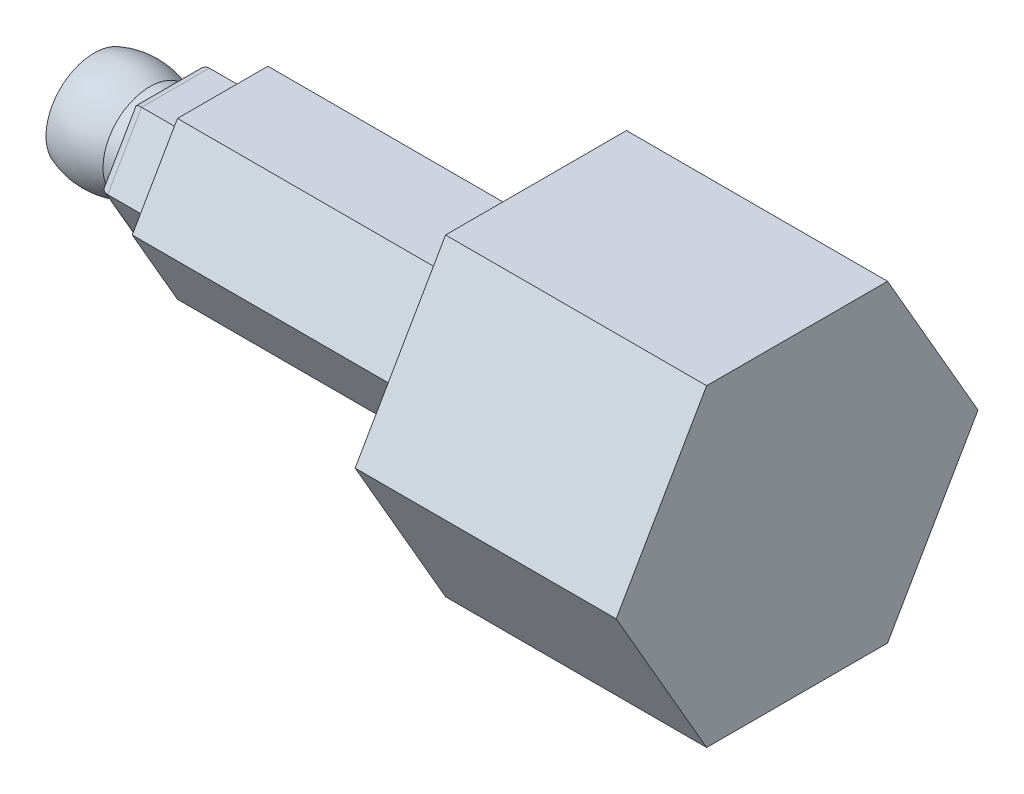
ISO-10303-21;
HEADER;
FILE_DESCRIPTION(('STEP AP214'),'2;1');
FILE_NAME('part.step','',(''),(''),'','','');
FILE_SCHEMA(('AUTOMOTIVE_DESIGN { 1 0 10303 214 1 1 1 1 }'));
ENDSEC;
DATA;
#1=APPLICATION_CONTEXT('core data for automotive mechanical design processes');
#2=APPLICATION_PROTOCOL_DEFINITION('international standard','automotive_design',2000,#1);
#3=PRODUCT_CONTEXT('',#1,'mechanical');
#4=PRODUCT('Part','Part','',(#3));
#5=PRODUCT_RELATED_PRODUCT_CATEGORY('part','',(#4));
#6=PRODUCT_DEFINITION_FORMATION('','',#4);
#7=PRODUCT_DEFINITION_CONTEXT('part definition',#1,'design');
#8=PRODUCT_DEFINITION('design','',#6,#7);
#9=PRODUCT_DEFINITION_SHAPE('','',#8);
#10=(LENGTH_UNIT() NAMED_UNIT(*) SI_UNIT(.MILLI.,.METRE.));
#11=(NAMED_UNIT(*) PLANE_ANGLE_UNIT() SI_UNIT($,.RADIAN.));
#12=(NAMED_UNIT(*) SI_UNIT($,.STERADIAN.) SOLID_ANGLE_UNIT());
#13=UNCERTAINTY_MEASURE_WITH_UNIT(LENGTH_MEASURE(1.E-05),#10,'distance_accuracy_value','');
#14=(GEOMETRIC_REPRESENTATION_CONTEXT(3) GLOBAL_UNCERTAINTY_ASSIGNED_CONTEXT((#13)) GLOBAL_UNIT_ASSIGNED_CONTEXT((#10,
#11,#12)) REPRESENTATION_CONTEXT('',''));
#15=CARTESIAN_POINT('',(0.,0.,0.));
#16=DIRECTION('',(0.,0.,1.));
#17=DIRECTION('',(1.,0.,0.));
#18=AXIS2_PLACEMENT_3D('',#15,#16,#17);
#19=CARTESIAN_POINT('',(149.3393,5.842,0.));
#20=DIRECTION('',(1.,0.,0.));
#21=DIRECTION('',(0.,1.,0.));
#22=AXIS2_PLACEMENT_3D('',#19,#20,#21);
#23=PLANE('',#22);
#24=CARTESIAN_POINT('',(149.3393,0.,0.));
#25=DIRECTION('',(-1.,0.,0.));
#26=DIRECTION('',(0.,-1.,0.));
#27=AXIS2_PLACEMENT_3D('',#24,#25,#26);
#28=CIRCLE('',#27,4.826);
#29=CARTESIAN_POINT('',(149.3393,-4.826,0.));
#30=VERTEX_POINT('',#29);
#31=EDGE_CURVE('E382',#30,#30,#28,.T.);
#32=ORIENTED_EDGE('',*,*,#31,.F.);
#33=EDGE_LOOP('',(#32));
#34=FACE_BOUND('',#33,.T.);
#35=CARTESIAN_POINT('',(149.3393,0.,0.));
#36=DIRECTION('',(-1.,0.,0.));
#37=DIRECTION('',(0.,-1.,0.));
#38=AXIS2_PLACEMENT_3D('',#35,#36,#37);
#39=CIRCLE('',#38,5.842);
#40=CARTESIAN_POINT('',(149.3393,-5.842,0.));
#41=VERTEX_POINT('',#40);
#42=EDGE_CURVE('E378',#41,#41,#39,.T.);
#43=ORIENTED_EDGE('',*,*,#42,.T.);
#44=EDGE_LOOP('',(#43));
#45=FACE_BOUND('',#44,.T.);
#46=ADVANCED_FACE('F66',(#34,#45),#23,.F.);
#47=CARTESIAN_POINT('',(149.3393,0.,0.));
#48=DIRECTION('',(-1.,0.,0.));
#49=DIRECTION('',(0.,-1.,0.));
#50=AXIS2_PLACEMENT_3D('',#47,#48,#49);
#51=CYLINDRICAL_SURFACE('',#50,4.826);
#52=CARTESIAN_POINT('',(156.9593,0.,0.));
#53=DIRECTION('',(-1.,0.,0.));
#54=DIRECTION('',(0.,-1.,0.));
#55=AXIS2_PLACEMENT_3D('',#52,#53,#54);
#56=CIRCLE('',#55,4.826);
#57=CARTESIAN_POINT('',(156.9593,-4.826,0.));
#58=VERTEX_POINT('',#57);
#59=EDGE_CURVE('E386',#58,#58,#56,.T.);
#60=ORIENTED_EDGE('',*,*,#59,.F.);
#61=EDGE_LOOP('',(#60));
#62=FACE_BOUND('',#61,.T.);
#63=ORIENTED_EDGE('',*,*,#31,.T.);
#64=EDGE_LOOP('',(#63));
#65=FACE_BOUND('',#64,.T.);
#66=ADVANCED_FACE('F497',(#62,#65),#51,.F.);
#67=CARTESIAN_POINT('',(156.9593,0.,0.));
#68=DIRECTION('',(-1.,0.,0.));
#69=DIRECTION('',(0.,-1.,0.));
#70=AXIS2_PLACEMENT_3D('',#67,#68,#69);
#71=CONICAL_SURFACE('',#70,4.826,0.349065850398867);
#72=CARTESIAN_POINT('',(159.4993,0.,0.));
#73=DIRECTION('',(-1.,0.,0.));
#74=DIRECTION('',(0.,-1.,0.));
#75=AXIS2_PLACEMENT_3D('',#72,#73,#74);
#76=CIRCLE('',#75,3.90151560496384);
#77=CARTESIAN_POINT('',(159.4993,-3.90151560496383,0.));
#78=VERTEX_POINT('',#77);
#79=EDGE_CURVE('E390',#78,#78,#76,.T.);
#80=ORIENTED_EDGE('',*,*,#79,.F.);
#81=EDGE_LOOP('',(#80));
#82=FACE_BOUND('',#81,.T.);
#83=ORIENTED_EDGE('',*,*,#59,.T.);
#84=EDGE_LOOP('',(#83));
#85=FACE_BOUND('',#84,.T.);
#86=ADVANCED_FACE('F503',(#82,#85),#71,.F.);
#87=CARTESIAN_POINT('',(159.4993,4.572,0.));
#88=DIRECTION('',(-1.,0.,0.));
#89=DIRECTION('',(0.,-1.,0.));
#90=AXIS2_PLACEMENT_3D('',#87,#88,#89);
#91=PLANE('',#90);
#92=CARTESIAN_POINT('',(159.4993,0.,0.));
#93=DIRECTION('',(-1.,0.,0.));
#94=DIRECTION('',(0.,-1.,0.));
#95=AXIS2_PLACEMENT_3D('',#92,#93,#94);
#96=CIRCLE('',#95,4.572);
#97=CARTESIAN_POINT('',(159.4993,-4.572,0.));
#98=VERTEX_POINT('',#97);
#99=EDGE_CURVE('E394',#98,#98,#96,.T.);
#100=ORIENTED_EDGE('',*,*,#99,.F.);
#101=EDGE_LOOP('',(#100));
#102=FACE_BOUND('',#101,.T.);
#103=ORIENTED_EDGE('',*,*,#79,.T.);
#104=EDGE_LOOP('',(#103));
#105=FACE_BOUND('',#104,.T.);
#106=ADVANCED_FACE('F514',(#102,#105),#91,.F.);
#107=CARTESIAN_POINT('',(149.3393,0.,0.));
#108=DIRECTION('',(-1.,0.,0.));
#109=DIRECTION('',(0.,-1.,0.));
#110=AXIS2_PLACEMENT_3D('',#107,#108,#109);
#111=CYLINDRICAL_SURFACE('',#110,4.572);
#112=ORIENTED_EDGE('',*,*,#99,.T.);
#113=EDGE_LOOP('',(#112));
#114=FACE_BOUND('',#113,.T.);
#115=CARTESIAN_POINT('',(164.9857,0.,0.));
#116=DIRECTION('',(1.,0.,0.));
#117=DIRECTION('',(0.,0.,-1.));
#118=AXIS2_PLACEMENT_3D('',#115,#116,#117);
#119=CIRCLE('',#118,4.572);
#120=CARTESIAN_POINT('',(164.9857,0.,-4.572));
#121=VERTEX_POINT('',#120);
#122=EDGE_CURVE('E70',#121,#121,#119,.F.);
#123=ORIENTED_EDGE('',*,*,#122,.F.);
#124=EDGE_LOOP('',(#123));
#125=FACE_BOUND('',#124,.T.);
#126=ADVANCED_FACE('F68',(#114,#125),#111,.F.);
#127=CARTESIAN_POINT('',(152.545582614775,0.,0.));
#128=DIRECTION('',(-1.,0.,0.));
#129=DIRECTION('',(0.,-1.,0.));
#130=AXIS2_PLACEMENT_3D('',#127,#128,#129);
#131=DEGENERATE_TOROIDAL_SURFACE('',#130,2.44967364252799,8.89,.F.);
#132=ORIENTED_EDGE('',*,*,#42,.F.);
#133=EDGE_LOOP('',(#132));
#134=FACE_BOUND('',#133,.T.);
#135=CARTESIAN_POINT('',(156.1211,0.,0.));
#136=DIRECTION('',(-1.,0.,0.));
#137=DIRECTION('',(0.,-1.,0.));
#138=AXIS2_PLACEMENT_3D('',#135,#136,#137);
#139=CIRCLE('',#138,5.68960000000005);
#140=CARTESIAN_POINT('',(156.1211,-5.68960000000005,0.));
#141=VERTEX_POINT('',#140);
#142=EDGE_CURVE('E374',#141,#141,#139,.T.);
#143=ORIENTED_EDGE('',*,*,#142,.T.);
#144=EDGE_LOOP('',(#143));
#145=FACE_BOUND('',#144,.T.);
#146=ADVANCED_FACE('F509',(#134,#145),#131,.F.);
#147=CARTESIAN_POINT('',(149.3393,0.,0.));
#148=DIRECTION('',(-1.,0.,0.));
#149=DIRECTION('',(0.,-1.,0.));
#150=AXIS2_PLACEMENT_3D('',#147,#148,#149);
#151=CYLINDRICAL_SURFACE('',#150,5.68960000000005);
#152=ORIENTED_EDGE('',*,*,#142,.F.);
#153=EDGE_LOOP('',(#152));
#154=FACE_BOUND('',#153,.T.);
#155=CARTESIAN_POINT('',(158.0515,0.,0.));
#156=DIRECTION('',(-1.,0.,0.));
#157=DIRECTION('',(0.,-1.,0.));
#158=AXIS2_PLACEMENT_3D('',#155,#156,#157);
#159=CIRCLE('',#158,5.68960000000005);
#160=CARTESIAN_POINT('',(158.0515,-5.68960000000004,0.));
#161=VERTEX_POINT('',#160);
#162=EDGE_CURVE('E370',#161,#161,#159,.T.);
#163=ORIENTED_EDGE('',*,*,#162,.T.);
#164=EDGE_LOOP('',(#163));
#165=FACE_BOUND('',#164,.T.);
#166=ADVANCED_FACE('F544',(#154,#165),#151,.T.);
#167=CARTESIAN_POINT('',(158.0515,7.1374,0.));
#168=DIRECTION('',(1.,0.,0.));
#169=DIRECTION('',(0.,1.,0.));
#170=AXIS2_PLACEMENT_3D('',#167,#168,#169);
#171=PLANE('',#170);
#172=DIRECTION('',(0.,0.,1.));
#173=VECTOR('',#172,1.);
#174=CARTESIAN_POINT('',(158.0515,-5.94677499999997,4.12077981131404));
#175=LINE('',#174,#173);
#176=CARTESIAN_POINT('',(158.0515,-5.94677499999997,-3.43337214706014));
#177=VERTEX_POINT('',#176);
#178=CARTESIAN_POINT('',(158.0515,-5.94677499999997,3.43337214706014));
#179=VERTEX_POINT('',#178);
#180=EDGE_CURVE('E358',#177,#179,#175,.T.);
#181=ORIENTED_EDGE('',*,*,#180,.T.);
#182=DIRECTION('',(0.,0.866025403784439,0.5));
#183=VECTOR('',#182,1.);
#184=CARTESIAN_POINT('',(158.0515,0.59531250000003,7.21044812624722));
#185=LINE('',#184,#183);
#186=CARTESIAN_POINT('',(158.0515,0.,6.86674429412027));
#187=VERTEX_POINT('',#186);
#188=EDGE_CURVE('E351',#179,#187,#185,.T.);
#189=ORIENTED_EDGE('',*,*,#188,.T.);
#190=DIRECTION('',(0.,0.866025403784439,-0.5));
#191=VECTOR('',#190,1.);
#192=CARTESIAN_POINT('',(158.0515,6.54208750000003,3.08966831493319));
#193=LINE('',#192,#191);
#194=CARTESIAN_POINT('',(158.0515,5.94677500000003,3.43337214706014));
#195=VERTEX_POINT('',#194);
#196=EDGE_CURVE('E354',#187,#195,#193,.T.);
#197=ORIENTED_EDGE('',*,*,#196,.T.);
#198=DIRECTION('',(0.,0.,-1.));
#199=VECTOR('',#198,1.);
#200=CARTESIAN_POINT('',(158.0515,5.94677500000003,-4.12077981131404));
#201=LINE('',#200,#199);
#202=CARTESIAN_POINT('',(158.0515,5.94677500000003,-3.43337214706014));
#203=VERTEX_POINT('',#202);
#204=EDGE_CURVE('E367',#195,#203,#201,.T.);
#205=ORIENTED_EDGE('',*,*,#204,.T.);
#206=DIRECTION('',(0.,-0.866025403784439,-0.5));
#207=VECTOR('',#206,1.);
#208=CARTESIAN_POINT('',(158.0515,-0.595312499999976,-7.21044812624722));
#209=LINE('',#208,#207);
#210=CARTESIAN_POINT('',(158.0515,0.,-6.86674429412027));
#211=VERTEX_POINT('',#210);
#212=EDGE_CURVE('E364',#203,#211,#209,.T.);
#213=ORIENTED_EDGE('',*,*,#212,.T.);
#214=DIRECTION('',(0.,-0.866025403784439,0.5));
#215=VECTOR('',#214,1.);
#216=CARTESIAN_POINT('',(158.0515,-6.54208749999997,-3.08966831493319));
#217=LINE('',#216,#215);
#218=EDGE_CURVE('E361',#211,#177,#217,.T.);
#219=ORIENTED_EDGE('',*,*,#218,.T.);
#220=EDGE_LOOP('',(#181,#189,#197,#205,#213,#219));
#221=FACE_BOUND('',#220,.T.);
#222=ORIENTED_EDGE('',*,*,#162,.F.);
#223=EDGE_LOOP('',(#222));
#224=FACE_BOUND('',#223,.T.);
#225=ADVANCED_FACE('F455',(#221,#224),#171,.F.);
#226=CARTESIAN_POINT('',(159.242125,8.32643750000001,2.05947336210469));
#227=DIRECTION('',(0.,-0.866025403784439,0.5));
#228=DIRECTION('',(0.,-0.5,-0.866025403784439));
#229=AXIS2_PLACEMENT_3D('',#226,#227,#228);
#230=CYLINDRICAL_SURFACE('',#229,1.190625);
#231=CARTESIAN_POINT('',(159.242125,0.,6.86674429412027));
#232=DIRECTION('',(0.,-1.,0.));
#233=DIRECTION('',(0.,0.,-1.));
#234=AXIS2_PLACEMENT_3D('',#231,#232,#233);
#235=ELLIPSE('',#234,1.3748153285078,1.190625);
#236=CARTESIAN_POINT('',(159.242125,0.,8.24155962262807));
#237=VERTEX_POINT('',#236);
#238=EDGE_CURVE('E76',#187,#237,#235,.F.);
#239=ORIENTED_EDGE('',*,*,#238,.T.);
#240=DIRECTION('',(0.,0.866025403784439,-0.5));
#241=VECTOR('',#240,1.);
#242=CARTESIAN_POINT('',(159.242125,0.,8.24155962262807));
#243=LINE('',#242,#241);
#244=CARTESIAN_POINT('',(159.242125,7.13740000000003,4.12077981131404));
#245=VERTEX_POINT('',#244);
#246=EDGE_CURVE('E347',#245,#237,#243,.F.);
#247=ORIENTED_EDGE('',*,*,#246,.F.);
#248=CARTESIAN_POINT('',(159.242125,5.94677500000003,3.43337214706014));
#249=DIRECTION('',(0.,-0.5,0.866025403784439));
#250=DIRECTION('',(0.,0.866025403784439,0.5));
#251=AXIS2_PLACEMENT_3D('',#248,#249,#250);
#252=ELLIPSE('',#251,1.3748153285078,1.190625);
#253=EDGE_CURVE('E12',#245,#195,#252,.T.);
#254=ORIENTED_EDGE('',*,*,#253,.T.);
#255=ORIENTED_EDGE('',*,*,#196,.F.);
#256=EDGE_LOOP('',(#239,#247,#254,#255));
#257=FACE_BOUND('',#256,.T.);
#258=ADVANCED_FACE('F459',(#257),#230,.T.);
#259=CARTESIAN_POINT('',(159.242125,5.94677500000003,0.));
#260=DIRECTION('',(0.,0.,1.));
#261=DIRECTION('',(0.,-1.,0.));
#262=AXIS2_PLACEMENT_3D('',#259,#260,#261);
#263=CYLINDRICAL_SURFACE('',#262,1.190625);
#264=CARTESIAN_POINT('',(159.242125,5.94677500000003,-3.43337214706014));
#265=DIRECTION('',(0.,0.5,0.866025403784438));
#266=DIRECTION('',(0.,-0.866025403784438,0.5));
#267=AXIS2_PLACEMENT_3D('',#264,#265,#266);
#268=ELLIPSE('',#267,1.3748153285078,1.190625);
#269=CARTESIAN_POINT('',(159.242125,7.13740000000003,-4.12077981131404));
#270=VERTEX_POINT('',#269);
#271=EDGE_CURVE('E326',#270,#203,#268,.T.);
#272=ORIENTED_EDGE('',*,*,#271,.T.);
#273=ORIENTED_EDGE('',*,*,#204,.F.);
#274=ORIENTED_EDGE('',*,*,#253,.F.);
#275=DIRECTION('',(0.,0.,-1.));
#276=VECTOR('',#275,1.);
#277=CARTESIAN_POINT('',(159.242125,7.13740000000003,4.12077981131404));
#278=LINE('',#277,#276);
#279=EDGE_CURVE('E332',#270,#245,#278,.F.);
#280=ORIENTED_EDGE('',*,*,#279,.F.);
#281=EDGE_LOOP('',(#272,#273,#274,#280));
#282=FACE_BOUND('',#281,.T.);
#283=ADVANCED_FACE('F453',(#282),#263,.T.);
#284=CARTESIAN_POINT('',(159.242125,2.37966250000001,8.24064307907572));
#285=DIRECTION('',(0.,-0.866025403784439,-0.5));
#286=DIRECTION('',(0.,0.5,-0.866025403784439));
#287=AXIS2_PLACEMENT_3D('',#284,#285,#286);
#288=CYLINDRICAL_SURFACE('',#287,1.190625);
#289=CARTESIAN_POINT('',(159.242125,-5.94677499999997,3.43337214706014));
#290=DIRECTION('',(0.,-0.5,-0.866025403784439));
#291=DIRECTION('',(0.,-0.866025403784439,0.5));
#292=AXIS2_PLACEMENT_3D('',#289,#290,#291);
#293=ELLIPSE('',#292,1.3748153285078,1.190625);
#294=CARTESIAN_POINT('',(159.242125,-7.13739999999997,4.12077981131404));
#295=VERTEX_POINT('',#294);
#296=EDGE_CURVE('E322',#179,#295,#293,.F.);
#297=ORIENTED_EDGE('',*,*,#296,.T.);
#298=DIRECTION('',(0.,0.866025403784439,0.5));
#299=VECTOR('',#298,1.);
#300=CARTESIAN_POINT('',(159.242125,-7.13739999999997,4.12077981131404));
#301=LINE('',#300,#299);
#302=EDGE_CURVE('E341',#237,#295,#301,.F.);
#303=ORIENTED_EDGE('',*,*,#302,.F.);
#304=ORIENTED_EDGE('',*,*,#238,.F.);
#305=ORIENTED_EDGE('',*,*,#188,.F.);
#306=EDGE_LOOP('',(#297,#303,#304,#305));
#307=FACE_BOUND('',#306,.T.);
#308=ADVANCED_FACE('F462',(#307),#288,.T.);
#309=CARTESIAN_POINT('',(164.9857,3.56870000000001,6.18116971697107));
#310=DIRECTION('',(0.,0.5,0.866025403784439));
#311=DIRECTION('',(0.,-0.866025403784439,0.5));
#312=AXIS2_PLACEMENT_3D('',#309,#310,#311);
#313=PLANE('',#312);
#314=DIRECTION('',(-1.,0.,0.));
#315=VECTOR('',#314,1.);
#316=CARTESIAN_POINT('',(164.9857,7.13740000000003,4.12077981131404));
#317=LINE('',#316,#315);
#318=CARTESIAN_POINT('',(164.9857,7.13740000000003,4.12077981131404));
#319=VERTEX_POINT('',#318);
#320=EDGE_CURVE('E398',#319,#245,#317,.T.);
#321=ORIENTED_EDGE('',*,*,#320,.T.);
#322=ORIENTED_EDGE('',*,*,#246,.T.);
#323=DIRECTION('',(-1.,0.,0.));
#324=VECTOR('',#323,1.);
#325=CARTESIAN_POINT('',(164.9857,0.,8.24155962262807));
#326=LINE('',#325,#324);
#327=CARTESIAN_POINT('',(164.9857,0.,8.24155962262807));
#328=VERTEX_POINT('',#327);
#329=EDGE_CURVE('E410',#328,#237,#326,.T.);
#330=ORIENTED_EDGE('',*,*,#329,.F.);
#331=DIRECTION('',(0.,0.866025403784439,-0.5));
#332=VECTOR('',#331,1.);
#333=CARTESIAN_POINT('',(164.9857,3.56870000000001,6.18116971697107));
#334=LINE('',#333,#332);
#335=EDGE_CURVE('E406',#328,#319,#334,.T.);
#336=ORIENTED_EDGE('',*,*,#335,.T.);
#337=EDGE_LOOP('',(#321,#322,#330,#336));
#338=FACE_BOUND('',#337,.T.);
#339=ADVANCED_FACE('F468',(#338),#313,.T.);
#340=CARTESIAN_POINT('',(159.242125,-5.94677499999997,0.));
#341=DIRECTION('',(0.,0.,-1.));
#342=DIRECTION('',(0.,1.,0.));
#343=AXIS2_PLACEMENT_3D('',#340,#341,#342);
#344=CYLINDRICAL_SURFACE('',#343,1.190625);
#345=CARTESIAN_POINT('',(159.242125,-5.94677499999997,-3.43337214706014));
#346=DIRECTION('',(0.,0.5,-0.866025403784439));
#347=DIRECTION('',(0.,0.866025403784439,0.5));
#348=AXIS2_PLACEMENT_3D('',#345,#346,#347);
#349=ELLIPSE('',#348,1.3748153285078,1.190625);
#350=CARTESIAN_POINT('',(159.242125,-7.13739999999997,-4.12077981131404));
#351=VERTEX_POINT('',#350);
#352=EDGE_CURVE('E313',#177,#351,#349,.F.);
#353=ORIENTED_EDGE('',*,*,#352,.T.);
#354=DIRECTION('',(0.,0.,1.));
#355=VECTOR('',#354,1.);
#356=CARTESIAN_POINT('',(159.242125,-7.13739999999997,-4.12077981131404));
#357=LINE('',#356,#355);
#358=EDGE_CURVE('E344',#295,#351,#357,.F.);
#359=ORIENTED_EDGE('',*,*,#358,.F.);
#360=ORIENTED_EDGE('',*,*,#296,.F.);
#361=ORIENTED_EDGE('',*,*,#180,.F.);
#362=EDGE_LOOP('',(#353,#359,#360,#361));
#363=FACE_BOUND('',#362,.T.);
#364=ADVANCED_FACE('F484',(#363),#344,.T.);
#365=CARTESIAN_POINT('',(164.9857,-3.56869999999999,6.18116971697104));
#366=DIRECTION('',(0.,-0.5,0.866025403784439));
#367=DIRECTION('',(0.,-0.866025403784439,-0.5));
#368=AXIS2_PLACEMENT_3D('',#365,#366,#367);
#369=PLANE('',#368);
#370=ORIENTED_EDGE('',*,*,#329,.T.);
#371=ORIENTED_EDGE('',*,*,#302,.T.);
#372=DIRECTION('',(-1.,0.,0.));
#373=VECTOR('',#372,1.);
#374=CARTESIAN_POINT('',(164.9857,-7.13739999999997,4.12077981131404));
#375=LINE('',#374,#373);
#376=CARTESIAN_POINT('',(164.9857,-7.13739999999997,4.12077981131404));
#377=VERTEX_POINT('',#376);
#378=EDGE_CURVE('E415',#377,#295,#375,.T.);
#379=ORIENTED_EDGE('',*,*,#378,.F.);
#380=DIRECTION('',(0.,0.866025403784439,0.5));
#381=VECTOR('',#380,1.);
#382=CARTESIAN_POINT('',(164.9857,-3.56869999999999,6.18116971697104));
#383=LINE('',#382,#381);
#384=EDGE_CURVE('E411',#377,#328,#383,.T.);
#385=ORIENTED_EDGE('',*,*,#384,.T.);
#386=EDGE_LOOP('',(#370,#371,#379,#385));
#387=FACE_BOUND('',#386,.T.);
#388=ADVANCED_FACE('F469',(#387),#369,.T.);
#389=CARTESIAN_POINT('',(159.242125,2.37966250000001,-8.24064307907572));
#390=DIRECTION('',(0.,0.866025403784439,-0.5));
#391=DIRECTION('',(0.,0.5,0.866025403784439));
#392=AXIS2_PLACEMENT_3D('',#389,#390,#391);
#393=CYLINDRICAL_SURFACE('',#392,1.190625);
#394=CARTESIAN_POINT('',(159.242125,0.,-6.86674429412027));
#395=DIRECTION('',(0.,1.,0.));
#396=DIRECTION('',(0.,0.,1.));
#397=AXIS2_PLACEMENT_3D('',#394,#395,#396);
#398=ELLIPSE('',#397,1.3748153285078,1.190625);
#399=CARTESIAN_POINT('',(159.242125,0.,-8.24155962262807));
#400=VERTEX_POINT('',#399);
#401=EDGE_CURVE('E317',#400,#211,#398,.T.);
#402=ORIENTED_EDGE('',*,*,#401,.F.);
#403=DIRECTION('',(0.,-0.866025403784439,0.5));
#404=VECTOR('',#403,1.);
#405=CARTESIAN_POINT('',(159.242125,0.,-8.24155962262807));
#406=LINE('',#405,#404);
#407=EDGE_CURVE('E338',#351,#400,#406,.F.);
#408=ORIENTED_EDGE('',*,*,#407,.F.);
#409=ORIENTED_EDGE('',*,*,#352,.F.);
#410=ORIENTED_EDGE('',*,*,#218,.F.);
#411=EDGE_LOOP('',(#402,#408,#409,#410));
#412=FACE_BOUND('',#411,.T.);
#413=ADVANCED_FACE('F479',(#412),#393,.T.);
#414=CARTESIAN_POINT('',(164.9857,-7.13739999999997,0.));
#415=DIRECTION('',(0.,-1.,0.));
#416=DIRECTION('',(0.,0.,-1.));
#417=AXIS2_PLACEMENT_3D('',#414,#415,#416);
#418=PLANE('',#417);
#419=ORIENTED_EDGE('',*,*,#378,.T.);
#420=ORIENTED_EDGE('',*,*,#358,.T.);
#421=DIRECTION('',(-1.,0.,0.));
#422=VECTOR('',#421,1.);
#423=CARTESIAN_POINT('',(164.9857,-7.13739999999997,-4.12077981131404));
#424=LINE('',#423,#422);
#425=CARTESIAN_POINT('',(164.9857,-7.13739999999997,-4.12077981131404));
#426=VERTEX_POINT('',#425);
#427=EDGE_CURVE('E421',#426,#351,#424,.T.);
#428=ORIENTED_EDGE('',*,*,#427,.F.);
#429=DIRECTION('',(0.,0.,1.));
#430=VECTOR('',#429,1.);
#431=CARTESIAN_POINT('',(164.9857,-7.13739999999997,0.));
#432=LINE('',#431,#430);
#433=EDGE_CURVE('E84',#426,#377,#432,.T.);
#434=ORIENTED_EDGE('',*,*,#433,.T.);
#435=EDGE_LOOP('',(#419,#420,#428,#434));
#436=FACE_BOUND('',#435,.T.);
#437=ADVANCED_FACE('F486',(#436),#418,.T.);
#438=CARTESIAN_POINT('',(164.9857,7.13740000000003,0.));
#439=DIRECTION('',(0.,1.,0.));
#440=DIRECTION('',(0.,0.,1.));
#441=AXIS2_PLACEMENT_3D('',#438,#439,#440);
#442=PLANE('',#441);
#443=DIRECTION('',(-1.,0.,0.));
#444=VECTOR('',#443,1.);
#445=CARTESIAN_POINT('',(164.9857,7.13740000000003,-4.12077981131404));
#446=LINE('',#445,#444);
#447=CARTESIAN_POINT('',(164.9857,7.13740000000003,-4.12077981131404));
#448=VERTEX_POINT('',#447);
#449=EDGE_CURVE('E318',#448,#270,#446,.T.);
#450=ORIENTED_EDGE('',*,*,#449,.T.);
#451=ORIENTED_EDGE('',*,*,#279,.T.);
#452=ORIENTED_EDGE('',*,*,#320,.F.);
#453=DIRECTION('',(0.,0.,-1.));
#454=VECTOR('',#453,1.);
#455=CARTESIAN_POINT('',(164.9857,7.13740000000003,0.));
#456=LINE('',#455,#454);
#457=EDGE_CURVE('E402',#319,#448,#456,.T.);
#458=ORIENTED_EDGE('',*,*,#457,.T.);
#459=EDGE_LOOP('',(#450,#451,#452,#458));
#460=FACE_BOUND('',#459,.T.);
#461=ADVANCED_FACE('F444',(#460),#442,.T.);
#462=CARTESIAN_POINT('',(159.242125,8.32643750000001,-2.05947336210469));
#463=DIRECTION('',(0.,0.866025403784439,0.5));
#464=DIRECTION('',(0.,-0.5,0.866025403784439));
#465=AXIS2_PLACEMENT_3D('',#462,#463,#464);
#466=CYLINDRICAL_SURFACE('',#465,1.190625);
#467=ORIENTED_EDGE('',*,*,#401,.T.);
#468=ORIENTED_EDGE('',*,*,#212,.F.);
#469=ORIENTED_EDGE('',*,*,#271,.F.);
#470=DIRECTION('',(0.,-0.866025403784439,-0.5));
#471=VECTOR('',#470,1.);
#472=CARTESIAN_POINT('',(159.242125,7.13740000000003,-4.12077981131404));
#473=LINE('',#472,#471);
#474=EDGE_CURVE('E335',#400,#270,#473,.F.);
#475=ORIENTED_EDGE('',*,*,#474,.F.);
#476=EDGE_LOOP('',(#467,#468,#469,#475));
#477=FACE_BOUND('',#476,.T.);
#478=ADVANCED_FACE('F451',(#477),#466,.T.);
#479=CARTESIAN_POINT('',(164.9857,-3.56869999999999,-6.18116971697104));
#480=DIRECTION('',(0.,-0.5,-0.866025403784438));
#481=DIRECTION('',(0.,0.866025403784439,-0.5));
#482=AXIS2_PLACEMENT_3D('',#479,#480,#481);
#483=PLANE('',#482);
#484=ORIENTED_EDGE('',*,*,#427,.T.);
#485=ORIENTED_EDGE('',*,*,#407,.T.);
#486=DIRECTION('',(-1.,0.,0.));
#487=VECTOR('',#486,1.);
#488=CARTESIAN_POINT('',(164.9857,0.,-8.24155962262807));
#489=LINE('',#488,#487);
#490=CARTESIAN_POINT('',(164.9857,0.,-8.24155962262807));
#491=VERTEX_POINT('',#490);
#492=EDGE_CURVE('E429',#491,#400,#489,.T.);
#493=ORIENTED_EDGE('',*,*,#492,.F.);
#494=DIRECTION('',(0.,-0.866025403784439,0.5));
#495=VECTOR('',#494,1.);
#496=CARTESIAN_POINT('',(164.9857,-3.56869999999999,-6.18116971697104));
#497=LINE('',#496,#495);
#498=EDGE_CURVE('E425',#491,#426,#497,.T.);
#499=ORIENTED_EDGE('',*,*,#498,.T.);
#500=EDGE_LOOP('',(#484,#485,#493,#499));
#501=FACE_BOUND('',#500,.T.);
#502=ADVANCED_FACE('F487',(#501),#483,.T.);
#503=CARTESIAN_POINT('',(164.9857,3.56870000000001,-6.18116971697107));
#504=DIRECTION('',(0.,0.5,-0.866025403784439));
#505=DIRECTION('',(0.,0.866025403784439,0.5));
#506=AXIS2_PLACEMENT_3D('',#503,#504,#505);
#507=PLANE('',#506);
#508=ORIENTED_EDGE('',*,*,#492,.T.);
#509=ORIENTED_EDGE('',*,*,#474,.T.);
#510=ORIENTED_EDGE('',*,*,#449,.F.);
#511=DIRECTION('',(0.,-0.866025403784439,-0.5));
#512=VECTOR('',#511,1.);
#513=CARTESIAN_POINT('',(164.9857,3.56870000000001,-6.18116971697107));
#514=LINE('',#513,#512);
#515=EDGE_CURVE('E433',#448,#491,#514,.T.);
#516=ORIENTED_EDGE('',*,*,#515,.T.);
#517=EDGE_LOOP('',(#508,#509,#510,#516));
#518=FACE_BOUND('',#517,.T.);
#519=ADVANCED_FACE('F473',(#518),#507,.T.);
#520=CARTESIAN_POINT('',(164.9857,0.,0.));
#521=DIRECTION('',(1.,0.,0.));
#522=DIRECTION('',(0.,0.,-1.));
#523=AXIS2_PLACEMENT_3D('',#520,#521,#522);
#524=PLANE('',#523);
#525=ORIENTED_EDGE('',*,*,#515,.F.);
#526=ORIENTED_EDGE('',*,*,#457,.F.);
#527=ORIENTED_EDGE('',*,*,#335,.F.);
#528=ORIENTED_EDGE('',*,*,#384,.F.);
#529=ORIENTED_EDGE('',*,*,#433,.F.);
#530=ORIENTED_EDGE('',*,*,#498,.F.);
#531=EDGE_LOOP('',(#525,#526,#527,#528,#529,#530));
#532=FACE_BOUND('',#531,.T.);
#533=DIRECTION('',(0.,0.,1.));
#534=VECTOR('',#533,1.);
#535=CARTESIAN_POINT('',(164.9857,9.525,-5.49926131403119));
#536=LINE('',#535,#534);
#537=CARTESIAN_POINT('',(164.9857,9.525,-5.49926131403119));
#538=VERTEX_POINT('',#537);
#539=CARTESIAN_POINT('',(164.9857,9.525,5.49926131403119));
#540=VERTEX_POINT('',#539);
#541=EDGE_CURVE('E240',#538,#540,#536,.T.);
#542=ORIENTED_EDGE('',*,*,#541,.F.);
#543=DIRECTION('',(0.,0.866025403784439,0.5));
#544=VECTOR('',#543,1.);
#545=CARTESIAN_POINT('',(164.9857,0.,-10.9985226280624));
#546=LINE('',#545,#544);
#547=CARTESIAN_POINT('',(164.9857,0.,-10.9985226280624));
#548=VERTEX_POINT('',#547);
#549=EDGE_CURVE('E256',#548,#538,#546,.T.);
#550=ORIENTED_EDGE('',*,*,#549,.F.);
#551=DIRECTION('',(0.,0.866025403784439,-0.5));
#552=VECTOR('',#551,1.);
#553=CARTESIAN_POINT('',(164.9857,-9.525,-5.49926131403119));
#554=LINE('',#553,#552);
#555=CARTESIAN_POINT('',(164.9857,-9.525,-5.49926131403119));
#556=VERTEX_POINT('',#555);
#557=EDGE_CURVE('E285',#556,#548,#554,.T.);
#558=ORIENTED_EDGE('',*,*,#557,.F.);
#559=DIRECTION('',(0.,0.,-1.));
#560=VECTOR('',#559,1.);
#561=CARTESIAN_POINT('',(164.9857,-9.525,5.49926131403119));
#562=LINE('',#561,#560);
#563=CARTESIAN_POINT('',(164.9857,-9.525,5.49926131403119));
#564=VERTEX_POINT('',#563);
#565=EDGE_CURVE('E282',#564,#556,#562,.T.);
#566=ORIENTED_EDGE('',*,*,#565,.F.);
#567=DIRECTION('',(0.,-0.866025403784439,-0.5));
#568=VECTOR('',#567,1.);
#569=CARTESIAN_POINT('',(164.9857,0.,10.9985226280624));
#570=LINE('',#569,#568);
#571=CARTESIAN_POINT('',(164.9857,0.,10.9985226280624));
#572=VERTEX_POINT('',#571);
#573=EDGE_CURVE('E279',#572,#564,#570,.T.);
#574=ORIENTED_EDGE('',*,*,#573,.F.);
#575=DIRECTION('',(0.,-0.866025403784439,0.5));
#576=VECTOR('',#575,1.);
#577=CARTESIAN_POINT('',(164.9857,9.525,5.49926131403119));
#578=LINE('',#577,#576);
#579=EDGE_CURVE('E245',#540,#572,#578,.T.);
#580=ORIENTED_EDGE('',*,*,#579,.F.);
#581=EDGE_LOOP('',(#542,#550,#558,#566,#574,#580));
#582=FACE_BOUND('',#581,.T.);
#583=ADVANCED_FACE('F470',(#532,#582),#524,.F.);
#584=CARTESIAN_POINT('',(203.0857,0.,-10.9985226280624));
#585=DIRECTION('',(0.,-0.5,0.866025403784439));
#586=DIRECTION('',(0.,-0.866025403784439,-0.5));
#587=AXIS2_PLACEMENT_3D('',#584,#585,#586);
#588=PLANE('',#587);
#589=ORIENTED_EDGE('',*,*,#549,.T.);
#590=DIRECTION('',(-1.,0.,0.));
#591=VECTOR('',#590,1.);
#592=CARTESIAN_POINT('',(203.0857,9.525,-5.49926131403119));
#593=LINE('',#592,#591);
#594=CARTESIAN_POINT('',(203.0857,9.525,-5.49926131403119));
#595=VERTEX_POINT('',#594);
#596=EDGE_CURVE('E275',#595,#538,#593,.T.);
#597=ORIENTED_EDGE('',*,*,#596,.F.);
#598=DIRECTION('',(0.,0.866025403784439,0.5));
#599=VECTOR('',#598,1.);
#600=CARTESIAN_POINT('',(203.0857,0.,-10.9985226280624));
#601=LINE('',#600,#599);
#602=CARTESIAN_POINT('',(203.0857,0.,-10.9985226280624));
#603=VERTEX_POINT('',#602);
#604=EDGE_CURVE('E272',#603,#595,#601,.T.);
#605=ORIENTED_EDGE('',*,*,#604,.F.);
#606=DIRECTION('',(-1.,0.,0.));
#607=VECTOR('',#606,1.);
#608=CARTESIAN_POINT('',(203.0857,0.,-10.9985226280624));
#609=LINE('',#608,#607);
#610=EDGE_CURVE('E293',#603,#548,#609,.T.);
#611=ORIENTED_EDGE('',*,*,#610,.T.);
#612=EDGE_LOOP('',(#589,#597,#605,#611));
#613=FACE_BOUND('',#612,.T.);
#614=ADVANCED_FACE('F583',(#613),#588,.F.);
#615=CARTESIAN_POINT('',(203.0857,-9.525,-5.49926131403119));
#616=DIRECTION('',(0.,0.5,0.866025403784439));
#617=DIRECTION('',(0.,-0.866025403784439,0.5));
#618=AXIS2_PLACEMENT_3D('',#615,#616,#617);
#619=PLANE('',#618);
#620=ORIENTED_EDGE('',*,*,#557,.T.);
#621=ORIENTED_EDGE('',*,*,#610,.F.);
#622=DIRECTION('',(0.,0.866025403784439,-0.5));
#623=VECTOR('',#622,1.);
#624=CARTESIAN_POINT('',(203.0857,-9.525,-5.49926131403119));
#625=LINE('',#624,#623);
#626=CARTESIAN_POINT('',(203.0857,-9.525,-5.49926131403119));
#627=VERTEX_POINT('',#626);
#628=EDGE_CURVE('E268',#627,#603,#625,.T.);
#629=ORIENTED_EDGE('',*,*,#628,.F.);
#630=DIRECTION('',(-1.,0.,0.));
#631=VECTOR('',#630,1.);
#632=CARTESIAN_POINT('',(203.0857,-9.525,-5.49926131403119));
#633=LINE('',#632,#631);
#634=EDGE_CURVE('E297',#627,#556,#633,.T.);
#635=ORIENTED_EDGE('',*,*,#634,.T.);
#636=EDGE_LOOP('',(#620,#621,#629,#635));
#637=FACE_BOUND('',#636,.T.);
#638=ADVANCED_FACE('F587',(#637),#619,.F.);
#639=CARTESIAN_POINT('',(203.0857,-9.525,5.49926131403119));
#640=DIRECTION('',(0.,1.,0.));
#641=DIRECTION('',(0.,0.,1.));
#642=AXIS2_PLACEMENT_3D('',#639,#640,#641);
#643=PLANE('',#642);
#644=ORIENTED_EDGE('',*,*,#565,.T.);
#645=ORIENTED_EDGE('',*,*,#634,.F.);
#646=DIRECTION('',(0.,0.,-1.));
#647=VECTOR('',#646,1.);
#648=CARTESIAN_POINT('',(203.0857,-9.525,5.49926131403119));
#649=LINE('',#648,#647);
#650=CARTESIAN_POINT('',(203.0857,-9.525,5.49926131403119));
#651=VERTEX_POINT('',#650);
#652=EDGE_CURVE('E264',#651,#627,#649,.T.);
#653=ORIENTED_EDGE('',*,*,#652,.F.);
#654=DIRECTION('',(-1.,0.,0.));
#655=VECTOR('',#654,1.);
#656=CARTESIAN_POINT('',(203.0857,-9.525,5.49926131403119));
#657=LINE('',#656,#655);
#658=EDGE_CURVE('E301',#651,#564,#657,.T.);
#659=ORIENTED_EDGE('',*,*,#658,.T.);
#660=EDGE_LOOP('',(#644,#645,#653,#659));
#661=FACE_BOUND('',#660,.T.);
#662=ADVANCED_FACE('F592',(#661),#643,.F.);
#663=CARTESIAN_POINT('',(203.0857,0.,10.9985226280624));
#664=DIRECTION('',(0.,0.5,-0.866025403784439));
#665=DIRECTION('',(0.,0.866025403784439,0.5));
#666=AXIS2_PLACEMENT_3D('',#663,#664,#665);
#667=PLANE('',#666);
#668=ORIENTED_EDGE('',*,*,#573,.T.);
#669=ORIENTED_EDGE('',*,*,#658,.F.);
#670=DIRECTION('',(0.,-0.866025403784439,-0.5));
#671=VECTOR('',#670,1.);
#672=CARTESIAN_POINT('',(203.0857,0.,10.9985226280624));
#673=LINE('',#672,#671);
#674=CARTESIAN_POINT('',(203.0857,0.,10.9985226280624));
#675=VERTEX_POINT('',#674);
#676=EDGE_CURVE('E260',#675,#651,#673,.T.);
#677=ORIENTED_EDGE('',*,*,#676,.F.);
#678=DIRECTION('',(-1.,0.,0.));
#679=VECTOR('',#678,1.);
#680=CARTESIAN_POINT('',(203.0857,0.,10.9985226280624));
#681=LINE('',#680,#679);
#682=EDGE_CURVE('E305',#675,#572,#681,.T.);
#683=ORIENTED_EDGE('',*,*,#682,.T.);
#684=EDGE_LOOP('',(#668,#669,#677,#683));
#685=FACE_BOUND('',#684,.T.);
#686=ADVANCED_FACE('F598',(#685),#667,.F.);
#687=CARTESIAN_POINT('',(203.0857,9.525,5.49926131403119));
#688=DIRECTION('',(0.,-0.5,-0.866025403784439));
#689=DIRECTION('',(0.,0.866025403784439,-0.5));
#690=AXIS2_PLACEMENT_3D('',#687,#688,#689);
#691=PLANE('',#690);
#692=ORIENTED_EDGE('',*,*,#579,.T.);
#693=ORIENTED_EDGE('',*,*,#682,.F.);
#694=DIRECTION('',(0.,-0.866025403784439,0.5));
#695=VECTOR('',#694,1.);
#696=CARTESIAN_POINT('',(203.0857,9.525,5.49926131403119));
#697=LINE('',#696,#695);
#698=CARTESIAN_POINT('',(203.0857,9.525,5.49926131403119));
#699=VERTEX_POINT('',#698);
#700=EDGE_CURVE('E255',#699,#675,#697,.T.);
#701=ORIENTED_EDGE('',*,*,#700,.F.);
#702=DIRECTION('',(-1.,0.,0.));
#703=VECTOR('',#702,1.);
#704=CARTESIAN_POINT('',(203.0857,9.525,5.49926131403119));
#705=LINE('',#704,#703);
#706=EDGE_CURVE('E309',#699,#540,#705,.T.);
#707=ORIENTED_EDGE('',*,*,#706,.T.);
#708=EDGE_LOOP('',(#692,#693,#701,#707));
#709=FACE_BOUND('',#708,.T.);
#710=ADVANCED_FACE('F578',(#709),#691,.F.);
#711=CARTESIAN_POINT('',(203.0857,9.525,-5.49926131403119));
#712=DIRECTION('',(0.,-1.,0.));
#713=DIRECTION('',(0.,0.,-1.));
#714=AXIS2_PLACEMENT_3D('',#711,#712,#713);
#715=PLANE('',#714);
#716=ORIENTED_EDGE('',*,*,#541,.T.);
#717=ORIENTED_EDGE('',*,*,#706,.F.);
#718=DIRECTION('',(0.,0.,1.));
#719=VECTOR('',#718,1.);
#720=CARTESIAN_POINT('',(203.0857,9.525,-5.49926131403119));
#721=LINE('',#720,#719);
#722=EDGE_CURVE('E251',#595,#699,#721,.T.);
#723=ORIENTED_EDGE('',*,*,#722,.F.);
#724=ORIENTED_EDGE('',*,*,#596,.T.);
#725=EDGE_LOOP('',(#716,#717,#723,#724));
#726=FACE_BOUND('',#725,.T.);
#727=ADVANCED_FACE('F533',(#726),#715,.F.);
#728=ORIENTED_EDGE('',*,*,#122,.T.);
#729=EDGE_LOOP('',(#728));
#730=FACE_BOUND('',#729,.T.);
#731=ADVANCED_FACE('F568',(#730),#524,.F.);
#732=CARTESIAN_POINT('',(203.0857,0.,0.));
#733=DIRECTION('',(1.,0.,0.));
#734=DIRECTION('',(0.,0.,-1.));
#735=AXIS2_PLACEMENT_3D('',#732,#733,#734);
#736=PLANE('',#735);
#737=DIRECTION('',(0.,0.,1.));
#738=VECTOR('',#737,1.);
#739=CARTESIAN_POINT('',(203.0857,19.05,-10.9985226280624));
#740=LINE('',#739,#738);
#741=CARTESIAN_POINT('',(203.0857,19.05,-10.9985226280624));
#742=VERTEX_POINT('',#741);
#743=CARTESIAN_POINT('',(203.0857,19.05,10.9985226280624));
#744=VERTEX_POINT('',#743);
#745=EDGE_CURVE('E238',#742,#744,#740,.T.);
#746=ORIENTED_EDGE('',*,*,#745,.F.);
#747=DIRECTION('',(0.,0.866025403784439,0.5));
#748=VECTOR('',#747,1.);
#749=CARTESIAN_POINT('',(203.0857,0.,-21.9970452561247));
#750=LINE('',#749,#748);
#751=CARTESIAN_POINT('',(203.0857,0.,-21.9970452561247));
#752=VERTEX_POINT('',#751);
#753=EDGE_CURVE('E234',#752,#742,#750,.T.);
#754=ORIENTED_EDGE('',*,*,#753,.F.);
#755=DIRECTION('',(0.,0.866025403784439,-0.5));
#756=VECTOR('',#755,1.);
#757=CARTESIAN_POINT('',(203.0857,-19.05,-10.9985226280624));
#758=LINE('',#757,#756);
#759=CARTESIAN_POINT('',(203.0857,-19.05,-10.9985226280624));
#760=VERTEX_POINT('',#759);
#761=EDGE_CURVE('E705',#760,#752,#758,.T.);
#762=ORIENTED_EDGE('',*,*,#761,.F.);
#763=DIRECTION('',(0.,0.,-1.));
#764=VECTOR('',#763,1.);
#765=CARTESIAN_POINT('',(203.0857,-19.05,10.9985226280624));
#766=LINE('',#765,#764);
#767=CARTESIAN_POINT('',(203.0857,-19.05,10.9985226280624));
#768=VERTEX_POINT('',#767);
#769=EDGE_CURVE('E721',#768,#760,#766,.T.);
#770=ORIENTED_EDGE('',*,*,#769,.F.);
#771=DIRECTION('',(0.,-0.866025403784439,-0.5));
#772=VECTOR('',#771,1.);
#773=CARTESIAN_POINT('',(203.0857,0.,21.9970452561247));
#774=LINE('',#773,#772);
#775=CARTESIAN_POINT('',(203.0857,0.,21.9970452561247));
#776=VERTEX_POINT('',#775);
#777=EDGE_CURVE('E714',#776,#768,#774,.T.);
#778=ORIENTED_EDGE('',*,*,#777,.F.);
#779=DIRECTION('',(0.,-0.866025403784439,0.5));
#780=VECTOR('',#779,1.);
#781=CARTESIAN_POINT('',(203.0857,19.05,10.9985226280624));
#782=LINE('',#781,#780);
#783=EDGE_CURVE('E710',#744,#776,#782,.T.);
#784=ORIENTED_EDGE('',*,*,#783,.F.);
#785=EDGE_LOOP('',(#746,#754,#762,#770,#778,#784));
#786=FACE_BOUND('',#785,.T.);
#787=ORIENTED_EDGE('',*,*,#604,.T.);
#788=ORIENTED_EDGE('',*,*,#722,.T.);
#789=ORIENTED_EDGE('',*,*,#700,.T.);
#790=ORIENTED_EDGE('',*,*,#676,.T.);
#791=ORIENTED_EDGE('',*,*,#652,.T.);
#792=ORIENTED_EDGE('',*,*,#628,.T.);
#793=EDGE_LOOP('',(#787,#788,#789,#790,#791,#792));
#794=FACE_BOUND('',#793,.T.);
#795=ADVANCED_FACE('F570',(#786,#794),#736,.F.);
#796=CARTESIAN_POINT('',(234.8357,19.05,-10.9985226280624));
#797=DIRECTION('',(0.,-1.,0.));
#798=DIRECTION('',(0.,0.,-1.));
#799=AXIS2_PLACEMENT_3D('',#796,#797,#798);
#800=PLANE('',#799);
#801=ORIENTED_EDGE('',*,*,#745,.T.);
#802=DIRECTION('',(-1.,0.,0.));
#803=VECTOR('',#802,1.);
#804=CARTESIAN_POINT('',(234.8357,19.05,10.9985226280624));
#805=LINE('',#804,#803);
#806=CARTESIAN_POINT('',(234.8357,19.05,10.9985226280624));
#807=VERTEX_POINT('',#806);
#808=EDGE_CURVE('E216',#807,#744,#805,.T.);
#809=ORIENTED_EDGE('',*,*,#808,.F.);
#810=DIRECTION('',(0.,0.,1.));
#811=VECTOR('',#810,1.);
#812=CARTESIAN_POINT('',(234.8357,19.05,-10.9985226280624));
#813=LINE('',#812,#811);
#814=CARTESIAN_POINT('',(234.8357,19.05,-10.9985226280624));
#815=VERTEX_POINT('',#814);
#816=EDGE_CURVE('E224',#815,#807,#813,.T.);
#817=ORIENTED_EDGE('',*,*,#816,.F.);
#818=DIRECTION('',(-1.,0.,0.));
#819=VECTOR('',#818,1.);
#820=CARTESIAN_POINT('',(234.8357,19.05,-10.9985226280624));
#821=LINE('',#820,#819);
#822=EDGE_CURVE('E700',#815,#742,#821,.T.);
#823=ORIENTED_EDGE('',*,*,#822,.T.);
#824=EDGE_LOOP('',(#801,#809,#817,#823));
#825=FACE_BOUND('',#824,.T.);
#826=ADVANCED_FACE('F236',(#825),#800,.F.);
#827=CARTESIAN_POINT('',(234.8357,19.05,10.9985226280624));
#828=DIRECTION('',(0.,-0.5,-0.866025403784439));
#829=DIRECTION('',(0.,0.866025403784439,-0.5));
#830=AXIS2_PLACEMENT_3D('',#827,#828,#829);
#831=PLANE('',#830);
#832=ORIENTED_EDGE('',*,*,#783,.T.);
#833=DIRECTION('',(-1.,0.,0.));
#834=VECTOR('',#833,1.);
#835=CARTESIAN_POINT('',(234.8357,0.,21.9970452561247));
#836=LINE('',#835,#834);
#837=CARTESIAN_POINT('',(234.8357,0.,21.9970452561247));
#838=VERTEX_POINT('',#837);
#839=EDGE_CURVE('E219',#838,#776,#836,.T.);
#840=ORIENTED_EDGE('',*,*,#839,.F.);
#841=DIRECTION('',(0.,-0.866025403784439,0.5));
#842=VECTOR('',#841,1.);
#843=CARTESIAN_POINT('',(234.8357,19.05,10.9985226280624));
#844=LINE('',#843,#842);
#845=EDGE_CURVE('E212',#807,#838,#844,.T.);
#846=ORIENTED_EDGE('',*,*,#845,.F.);
#847=ORIENTED_EDGE('',*,*,#808,.T.);
#848=EDGE_LOOP('',(#832,#840,#846,#847));
#849=FACE_BOUND('',#848,.T.);
#850=ADVANCED_FACE('F214',(#849),#831,.F.);
#851=CARTESIAN_POINT('',(234.8357,0.,21.9970452561247));
#852=DIRECTION('',(0.,0.5,-0.866025403784439));
#853=DIRECTION('',(0.,0.866025403784439,0.5));
#854=AXIS2_PLACEMENT_3D('',#851,#852,#853);
#855=PLANE('',#854);
#856=ORIENTED_EDGE('',*,*,#777,.T.);
#857=DIRECTION('',(-1.,0.,0.));
#858=VECTOR('',#857,1.);
#859=CARTESIAN_POINT('',(234.8357,-19.05,10.9985226280624));
#860=LINE('',#859,#858);
#861=CARTESIAN_POINT('',(234.8357,-19.05,10.9985226280624));
#862=VERTEX_POINT('',#861);
#863=EDGE_CURVE('E247',#862,#768,#860,.T.);
#864=ORIENTED_EDGE('',*,*,#863,.F.);
#865=DIRECTION('',(0.,-0.866025403784439,-0.5));
#866=VECTOR('',#865,1.);
#867=CARTESIAN_POINT('',(234.8357,0.,21.9970452561247));
#868=LINE('',#867,#866);
#869=EDGE_CURVE('E223',#838,#862,#868,.T.);
#870=ORIENTED_EDGE('',*,*,#869,.F.);
#871=ORIENTED_EDGE('',*,*,#839,.T.);
#872=EDGE_LOOP('',(#856,#864,#870,#871));
#873=FACE_BOUND('',#872,.T.);
#874=ADVANCED_FACE('F647',(#873),#855,.F.);
#875=CARTESIAN_POINT('',(234.8357,-19.05,10.9985226280624));
#876=DIRECTION('',(0.,1.,0.));
#877=DIRECTION('',(0.,0.,1.));
#878=AXIS2_PLACEMENT_3D('',#875,#876,#877);
#879=PLANE('',#878);
#880=ORIENTED_EDGE('',*,*,#769,.T.);
#881=DIRECTION('',(-1.,0.,0.));
#882=VECTOR('',#881,1.);
#883=CARTESIAN_POINT('',(234.8357,-19.05,-10.9985226280624));
#884=LINE('',#883,#882);
#885=CARTESIAN_POINT('',(234.8357,-19.05,-10.9985226280624));
#886=VERTEX_POINT('',#885);
#887=EDGE_CURVE('E728',#886,#760,#884,.T.);
#888=ORIENTED_EDGE('',*,*,#887,.F.);
#889=DIRECTION('',(0.,0.,-1.));
#890=VECTOR('',#889,1.);
#891=CARTESIAN_POINT('',(234.8357,-19.05,10.9985226280624));
#892=LINE('',#891,#890);
#893=EDGE_CURVE('E737',#862,#886,#892,.T.);
#894=ORIENTED_EDGE('',*,*,#893,.F.);
#895=ORIENTED_EDGE('',*,*,#863,.T.);
#896=EDGE_LOOP('',(#880,#888,#894,#895));
#897=FACE_BOUND('',#896,.T.);
#898=ADVANCED_FACE('F656',(#897),#879,.F.);
#899=CARTESIAN_POINT('',(234.8357,-19.05,-10.9985226280624));
#900=DIRECTION('',(0.,0.5,0.866025403784439));
#901=DIRECTION('',(0.,-0.866025403784439,0.5));
#902=AXIS2_PLACEMENT_3D('',#899,#900,#901);
#903=PLANE('',#902);
#904=ORIENTED_EDGE('',*,*,#761,.T.);
#905=DIRECTION('',(-1.,0.,0.));
#906=VECTOR('',#905,1.);
#907=CARTESIAN_POINT('',(234.8357,0.,-21.9970452561247));
#908=LINE('',#907,#906);
#909=CARTESIAN_POINT('',(234.8357,0.,-21.9970452561247));
#910=VERTEX_POINT('',#909);
#911=EDGE_CURVE('E702',#910,#752,#908,.T.);
#912=ORIENTED_EDGE('',*,*,#911,.F.);
#913=DIRECTION('',(0.,0.866025403784439,-0.5));
#914=VECTOR('',#913,1.);
#915=CARTESIAN_POINT('',(234.8357,-19.05,-10.9985226280624));
#916=LINE('',#915,#914);
#917=EDGE_CURVE('E739',#886,#910,#916,.T.);
#918=ORIENTED_EDGE('',*,*,#917,.F.);
#919=ORIENTED_EDGE('',*,*,#887,.T.);
#920=EDGE_LOOP('',(#904,#912,#918,#919));
#921=FACE_BOUND('',#920,.T.);
#922=ADVANCED_FACE('F666',(#921),#903,.F.);
#923=CARTESIAN_POINT('',(234.8357,0.,-21.9970452561247));
#924=DIRECTION('',(0.,-0.5,0.866025403784439));
#925=DIRECTION('',(0.,-0.866025403784439,-0.5));
#926=AXIS2_PLACEMENT_3D('',#923,#924,#925);
#927=PLANE('',#926);
#928=ORIENTED_EDGE('',*,*,#753,.T.);
#929=ORIENTED_EDGE('',*,*,#822,.F.);
#930=DIRECTION('',(0.,0.866025403784439,0.5));
#931=VECTOR('',#930,1.);
#932=CARTESIAN_POINT('',(234.8357,0.,-21.9970452561247));
#933=LINE('',#932,#931);
#934=EDGE_CURVE('E229',#910,#815,#933,.T.);
#935=ORIENTED_EDGE('',*,*,#934,.F.);
#936=ORIENTED_EDGE('',*,*,#911,.T.);
#937=EDGE_LOOP('',(#928,#929,#935,#936));
#938=FACE_BOUND('',#937,.T.);
#939=ADVANCED_FACE('F676',(#938),#927,.F.);
#940=CARTESIAN_POINT('',(234.8357,0.,0.));
#941=DIRECTION('',(1.,0.,0.));
#942=DIRECTION('',(0.,0.,-1.));
#943=AXIS2_PLACEMENT_3D('',#940,#941,#942);
#944=PLANE('',#943);
#945=ORIENTED_EDGE('',*,*,#816,.T.);
#946=ORIENTED_EDGE('',*,*,#845,.T.);
#947=ORIENTED_EDGE('',*,*,#869,.T.);
#948=ORIENTED_EDGE('',*,*,#893,.T.);
#949=ORIENTED_EDGE('',*,*,#917,.T.);
#950=ORIENTED_EDGE('',*,*,#934,.T.);
#951=EDGE_LOOP('',(#945,#946,#947,#948,#949,#950));
#952=FACE_BOUND('',#951,.T.);
#953=ADVANCED_FACE('F227',(#952),#944,.T.);
#954=CLOSED_SHELL('',(#46,#66,#86,#106,#126,#146,#166,#225,#258,#283,#308,#339,#364,#388,#413,
#437,#461,#478,#502,#519,#583,#614,#638,#662,#686,#710,#727,#731,#795,#826,#850,#874,#898,#922,
#939,#953));
#955=MANIFOLD_SOLID_BREP('B2',#954);
#956=ADVANCED_BREP_SHAPE_REPRESENTATION('',(#18,#955),#14);
#957=SHAPE_DEFINITION_REPRESENTATION(#9,#956);
ENDSEC;
END-ISO-10303-21;
